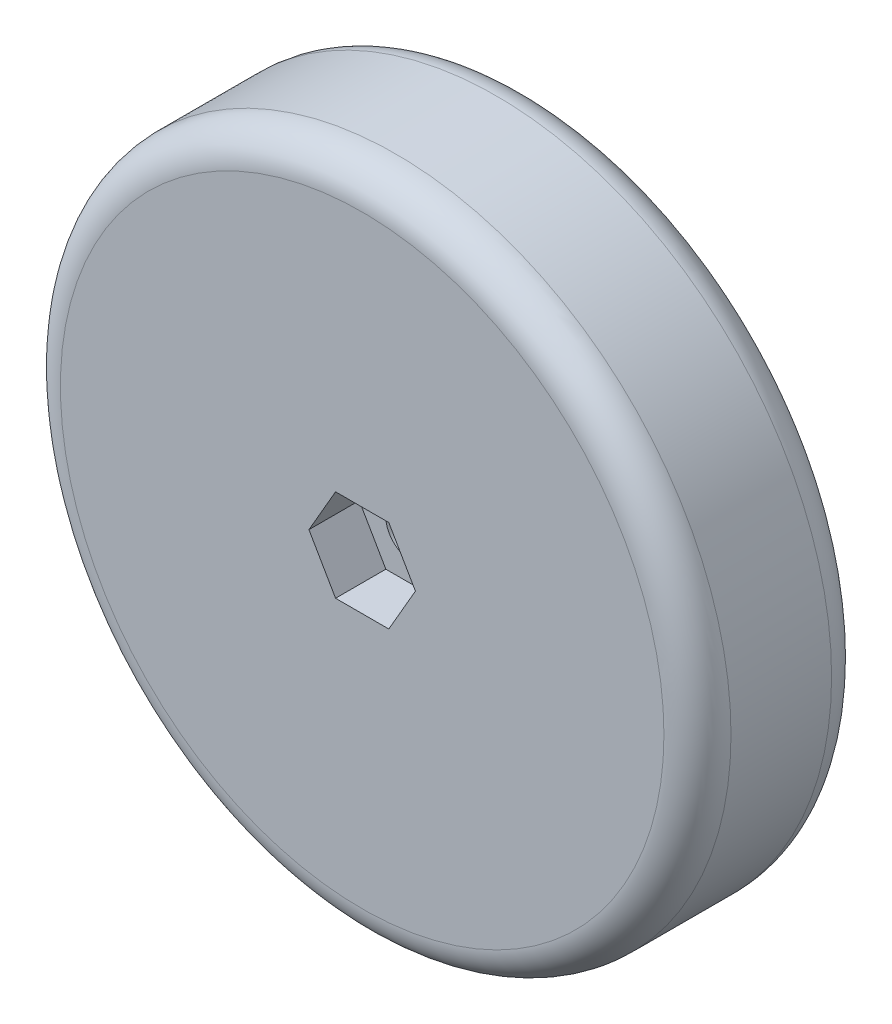
ISO-10303-21;
HEADER;
FILE_DESCRIPTION(('STEP AP214'),'2;1');
FILE_NAME('part.step','',(''),(''),'','','');
FILE_SCHEMA(('AUTOMOTIVE_DESIGN { 1 0 10303 214 1 1 1 1 }'));
ENDSEC;
DATA;
#1=APPLICATION_CONTEXT('core data for automotive mechanical design processes');
#2=APPLICATION_PROTOCOL_DEFINITION('international standard','automotive_design',2000,#1);
#3=PRODUCT_CONTEXT('',#1,'mechanical');
#4=PRODUCT('Part','Part','',(#3));
#5=PRODUCT_RELATED_PRODUCT_CATEGORY('part','',(#4));
#6=PRODUCT_DEFINITION_FORMATION('','',#4);
#7=PRODUCT_DEFINITION_CONTEXT('part definition',#1,'design');
#8=PRODUCT_DEFINITION('design','',#6,#7);
#9=PRODUCT_DEFINITION_SHAPE('','',#8);
#10=(LENGTH_UNIT() NAMED_UNIT(*) SI_UNIT(.MILLI.,.METRE.));
#11=(NAMED_UNIT(*) PLANE_ANGLE_UNIT() SI_UNIT($,.RADIAN.));
#12=(NAMED_UNIT(*) SI_UNIT($,.STERADIAN.) SOLID_ANGLE_UNIT());
#13=UNCERTAINTY_MEASURE_WITH_UNIT(LENGTH_MEASURE(1.E-05),#10,'distance_accuracy_value','');
#14=(GEOMETRIC_REPRESENTATION_CONTEXT(3) GLOBAL_UNCERTAINTY_ASSIGNED_CONTEXT((#13)) GLOBAL_UNIT_ASSIGNED_CONTEXT((#10,
#11,#12)) REPRESENTATION_CONTEXT('',''));
#15=CARTESIAN_POINT('',(0.,0.,0.));
#16=DIRECTION('',(0.,0.,1.));
#17=DIRECTION('',(1.,0.,0.));
#18=AXIS2_PLACEMENT_3D('',#15,#16,#17);
#19=CARTESIAN_POINT('',(0.,0.,0.));
#20=DIRECTION('',(0.,0.,1.));
#21=DIRECTION('',(1.,0.,0.));
#22=AXIS2_PLACEMENT_3D('',#19,#20,#21);
#23=PLANE('',#22);
#24=CARTESIAN_POINT('',(0.,0.,0.));
#25=DIRECTION('',(0.,0.,1.));
#26=DIRECTION('',(1.,0.,0.));
#27=AXIS2_PLACEMENT_3D('',#24,#25,#26);
#28=CIRCLE('',#27,18.);
#29=CARTESIAN_POINT('',(18.,0.,0.));
#30=VERTEX_POINT('',#29);
#31=EDGE_CURVE('E152',#30,#30,#28,.F.);
#32=ORIENTED_EDGE('',*,*,#31,.T.);
#33=EDGE_LOOP('',(#32));
#34=FACE_BOUND('',#33,.T.);
#35=CARTESIAN_POINT('',(0.,0.,0.));
#36=DIRECTION('',(0.,0.,1.));
#37=DIRECTION('',(1.,0.,0.));
#38=AXIS2_PLACEMENT_3D('',#35,#36,#37);
#39=CIRCLE('',#38,5.);
#40=CARTESIAN_POINT('',(5.,0.,0.));
#41=VERTEX_POINT('',#40);
#42=EDGE_CURVE('E11',#41,#41,#39,.F.);
#43=ORIENTED_EDGE('',*,*,#42,.F.);
#44=EDGE_LOOP('',(#43));
#45=FACE_BOUND('',#44,.T.);
#46=ADVANCED_FACE('F35',(#34,#45),#23,.F.);
#47=CARTESIAN_POINT('',(0.,0.,10.));
#48=DIRECTION('',(0.,0.,-1.));
#49=DIRECTION('',(-1.,0.,0.));
#50=AXIS2_PLACEMENT_3D('',#47,#48,#49);
#51=CYLINDRICAL_SURFACE('',#50,1.6);
#52=CARTESIAN_POINT('',(0.,0.,7.));
#53=DIRECTION('',(0.,0.,1.));
#54=DIRECTION('',(1.,0.,0.));
#55=AXIS2_PLACEMENT_3D('',#52,#53,#54);
#56=CIRCLE('',#55,1.6);
#57=CARTESIAN_POINT('',(1.6,0.,7.));
#58=VERTEX_POINT('',#57);
#59=EDGE_CURVE('E138',#58,#58,#56,.T.);
#60=ORIENTED_EDGE('',*,*,#59,.T.);
#61=EDGE_LOOP('',(#60));
#62=FACE_BOUND('',#61,.T.);
#63=CARTESIAN_POINT('',(0.,0.,-0.5));
#64=DIRECTION('',(0.,0.,-1.));
#65=DIRECTION('',(-1.,0.,0.));
#66=AXIS2_PLACEMENT_3D('',#63,#64,#65);
#67=CIRCLE('',#66,1.6);
#68=CARTESIAN_POINT('',(-1.6,0.,-0.5));
#69=VERTEX_POINT('',#68);
#70=EDGE_CURVE('E277',#69,#69,#67,.T.);
#71=ORIENTED_EDGE('',*,*,#70,.T.);
#72=EDGE_LOOP('',(#71));
#73=FACE_BOUND('',#72,.T.);
#74=ADVANCED_FACE('F175',(#62,#73),#51,.F.);
#75=CARTESIAN_POINT('',(0.,0.,10.));
#76=DIRECTION('',(0.,0.,1.));
#77=DIRECTION('',(1.,0.,0.));
#78=AXIS2_PLACEMENT_3D('',#75,#76,#77);
#79=PLANE('',#78);
#80=CARTESIAN_POINT('',(0.,0.,10.));
#81=DIRECTION('',(0.,0.,1.));
#82=DIRECTION('',(1.,0.,0.));
#83=AXIS2_PLACEMENT_3D('',#80,#81,#82);
#84=CIRCLE('',#83,18.);
#85=CARTESIAN_POINT('',(18.,0.,10.));
#86=VERTEX_POINT('',#85);
#87=EDGE_CURVE('E43',#86,#86,#84,.T.);
#88=ORIENTED_EDGE('',*,*,#87,.T.);
#89=EDGE_LOOP('',(#88));
#90=FACE_BOUND('',#89,.T.);
#91=DIRECTION('',(0.5,0.866025403784439,0.));
#92=VECTOR('',#91,1.);
#93=CARTESIAN_POINT('',(1.58771324027147,-2.75,10.));
#94=LINE('',#93,#92);
#95=CARTESIAN_POINT('',(1.58771324027147,-2.75,10.));
#96=VERTEX_POINT('',#95);
#97=CARTESIAN_POINT('',(3.17542648054294,0.,10.));
#98=VERTEX_POINT('',#97);
#99=EDGE_CURVE('E50',#96,#98,#94,.T.);
#100=ORIENTED_EDGE('',*,*,#99,.F.);
#101=DIRECTION('',(1.,0.,0.));
#102=VECTOR('',#101,1.);
#103=CARTESIAN_POINT('',(-1.58771324027147,-2.75,10.));
#104=LINE('',#103,#102);
#105=CARTESIAN_POINT('',(-1.58771324027147,-2.75,10.));
#106=VERTEX_POINT('',#105);
#107=EDGE_CURVE('E134',#106,#96,#104,.T.);
#108=ORIENTED_EDGE('',*,*,#107,.F.);
#109=DIRECTION('',(0.5,-0.866025403784439,0.));
#110=VECTOR('',#109,1.);
#111=CARTESIAN_POINT('',(-3.17542648054294,0.,10.));
#112=LINE('',#111,#110);
#113=CARTESIAN_POINT('',(-3.17542648054294,0.,10.));
#114=VERTEX_POINT('',#113);
#115=EDGE_CURVE('E132',#114,#106,#112,.T.);
#116=ORIENTED_EDGE('',*,*,#115,.F.);
#117=DIRECTION('',(-0.5,-0.866025403784439,0.));
#118=VECTOR('',#117,1.);
#119=CARTESIAN_POINT('',(-1.58771324027147,2.75,10.));
#120=LINE('',#119,#118);
#121=CARTESIAN_POINT('',(-1.58771324027147,2.75,10.));
#122=VERTEX_POINT('',#121);
#123=EDGE_CURVE('E98',#122,#114,#120,.T.);
#124=ORIENTED_EDGE('',*,*,#123,.F.);
#125=DIRECTION('',(-1.,0.,0.));
#126=VECTOR('',#125,1.);
#127=CARTESIAN_POINT('',(1.58771324027147,2.75,10.));
#128=LINE('',#127,#126);
#129=CARTESIAN_POINT('',(1.58771324027147,2.75,10.));
#130=VERTEX_POINT('',#129);
#131=EDGE_CURVE('E128',#130,#122,#128,.T.);
#132=ORIENTED_EDGE('',*,*,#131,.F.);
#133=DIRECTION('',(-0.5,0.866025403784438,0.));
#134=VECTOR('',#133,1.);
#135=CARTESIAN_POINT('',(3.17542648054294,0.,10.));
#136=LINE('',#135,#134);
#137=EDGE_CURVE('E124',#98,#130,#136,.T.);
#138=ORIENTED_EDGE('',*,*,#137,.F.);
#139=EDGE_LOOP('',(#100,#108,#116,#124,#132,#138));
#140=FACE_BOUND('',#139,.T.);
#141=ADVANCED_FACE('F157',(#90,#140),#79,.T.);
#142=CARTESIAN_POINT('',(0.,0.,10.));
#143=DIRECTION('',(0.,0.,-1.));
#144=DIRECTION('',(-1.,0.,0.));
#145=AXIS2_PLACEMENT_3D('',#142,#143,#144);
#146=CYLINDRICAL_SURFACE('',#145,20.);
#147=CARTESIAN_POINT('',(0.,0.,2.));
#148=DIRECTION('',(0.,0.,1.));
#149=DIRECTION('',(1.,0.,0.));
#150=AXIS2_PLACEMENT_3D('',#147,#148,#149);
#151=CIRCLE('',#150,20.);
#152=CARTESIAN_POINT('',(20.,0.,2.));
#153=VERTEX_POINT('',#152);
#154=EDGE_CURVE('E149',#153,#153,#151,.T.);
#155=ORIENTED_EDGE('',*,*,#154,.T.);
#156=EDGE_LOOP('',(#155));
#157=FACE_BOUND('',#156,.T.);
#158=CARTESIAN_POINT('',(0.,0.,8.));
#159=DIRECTION('',(0.,0.,1.));
#160=DIRECTION('',(1.,0.,0.));
#161=AXIS2_PLACEMENT_3D('',#158,#159,#160);
#162=CIRCLE('',#161,20.);
#163=CARTESIAN_POINT('',(20.,0.,8.));
#164=VERTEX_POINT('',#163);
#165=EDGE_CURVE('E146',#164,#164,#162,.F.);
#166=ORIENTED_EDGE('',*,*,#165,.T.);
#167=EDGE_LOOP('',(#166));
#168=FACE_BOUND('',#167,.T.);
#169=ADVANCED_FACE('F187',(#157,#168),#146,.T.);
#170=CARTESIAN_POINT('',(1.58771324027147,-2.75,7.));
#171=DIRECTION('',(0.866025403784439,-0.5,0.));
#172=DIRECTION('',(0.5,0.866025403784439,0.));
#173=AXIS2_PLACEMENT_3D('',#170,#171,#172);
#174=PLANE('',#173);
#175=ORIENTED_EDGE('',*,*,#99,.T.);
#176=DIRECTION('',(0.,0.,1.));
#177=VECTOR('',#176,1.);
#178=CARTESIAN_POINT('',(3.17542648054294,0.,7.));
#179=LINE('',#178,#177);
#180=CARTESIAN_POINT('',(3.17542648054294,0.,7.));
#181=VERTEX_POINT('',#180);
#182=EDGE_CURVE('E80',#181,#98,#179,.T.);
#183=ORIENTED_EDGE('',*,*,#182,.F.);
#184=DIRECTION('',(0.5,0.866025403784439,0.));
#185=VECTOR('',#184,1.);
#186=CARTESIAN_POINT('',(1.58771324027147,-2.75,7.));
#187=LINE('',#186,#185);
#188=CARTESIAN_POINT('',(1.58771324027147,-2.75,7.));
#189=VERTEX_POINT('',#188);
#190=EDGE_CURVE('E136',#189,#181,#187,.T.);
#191=ORIENTED_EDGE('',*,*,#190,.F.);
#192=DIRECTION('',(0.,0.,1.));
#193=VECTOR('',#192,1.);
#194=CARTESIAN_POINT('',(1.58771324027147,-2.75,7.));
#195=LINE('',#194,#193);
#196=EDGE_CURVE('E58',#189,#96,#195,.T.);
#197=ORIENTED_EDGE('',*,*,#196,.T.);
#198=EDGE_LOOP('',(#175,#183,#191,#197));
#199=FACE_BOUND('',#198,.T.);
#200=ADVANCED_FACE('F189',(#199),#174,.F.);
#201=CARTESIAN_POINT('',(-1.58771324027147,-2.75,7.));
#202=DIRECTION('',(0.,-1.,0.));
#203=DIRECTION('',(1.,0.,0.));
#204=AXIS2_PLACEMENT_3D('',#201,#202,#203);
#205=PLANE('',#204);
#206=ORIENTED_EDGE('',*,*,#107,.T.);
#207=ORIENTED_EDGE('',*,*,#196,.F.);
#208=DIRECTION('',(1.,0.,0.));
#209=VECTOR('',#208,1.);
#210=CARTESIAN_POINT('',(-1.58771324027147,-2.75,7.));
#211=LINE('',#210,#209);
#212=CARTESIAN_POINT('',(-1.58771324027147,-2.75,7.));
#213=VERTEX_POINT('',#212);
#214=EDGE_CURVE('E110',#213,#189,#211,.T.);
#215=ORIENTED_EDGE('',*,*,#214,.F.);
#216=DIRECTION('',(0.,0.,1.));
#217=VECTOR('',#216,1.);
#218=CARTESIAN_POINT('',(-1.58771324027147,-2.75,7.));
#219=LINE('',#218,#217);
#220=EDGE_CURVE('E102',#213,#106,#219,.T.);
#221=ORIENTED_EDGE('',*,*,#220,.T.);
#222=EDGE_LOOP('',(#206,#207,#215,#221));
#223=FACE_BOUND('',#222,.T.);
#224=ADVANCED_FACE('F195',(#223),#205,.F.);
#225=CARTESIAN_POINT('',(-3.17542648054294,0.,7.));
#226=DIRECTION('',(-0.866025403784439,-0.5,0.));
#227=DIRECTION('',(0.5,-0.866025403784439,0.));
#228=AXIS2_PLACEMENT_3D('',#225,#226,#227);
#229=PLANE('',#228);
#230=ORIENTED_EDGE('',*,*,#115,.T.);
#231=ORIENTED_EDGE('',*,*,#220,.F.);
#232=DIRECTION('',(0.5,-0.866025403784439,0.));
#233=VECTOR('',#232,1.);
#234=CARTESIAN_POINT('',(-3.17542648054294,0.,7.));
#235=LINE('',#234,#233);
#236=CARTESIAN_POINT('',(-3.17542648054294,0.,7.));
#237=VERTEX_POINT('',#236);
#238=EDGE_CURVE('E106',#237,#213,#235,.T.);
#239=ORIENTED_EDGE('',*,*,#238,.F.);
#240=DIRECTION('',(0.,0.,1.));
#241=VECTOR('',#240,1.);
#242=CARTESIAN_POINT('',(-3.17542648054294,0.,7.));
#243=LINE('',#242,#241);
#244=EDGE_CURVE('E91',#237,#114,#243,.T.);
#245=ORIENTED_EDGE('',*,*,#244,.T.);
#246=EDGE_LOOP('',(#230,#231,#239,#245));
#247=FACE_BOUND('',#246,.T.);
#248=ADVANCED_FACE('F107',(#247),#229,.F.);
#249=CARTESIAN_POINT('',(-1.58771324027147,2.75,7.));
#250=DIRECTION('',(-0.866025403784439,0.5,0.));
#251=DIRECTION('',(-0.5,-0.866025403784439,0.));
#252=AXIS2_PLACEMENT_3D('',#249,#250,#251);
#253=PLANE('',#252);
#254=ORIENTED_EDGE('',*,*,#123,.T.);
#255=ORIENTED_EDGE('',*,*,#244,.F.);
#256=DIRECTION('',(-0.5,-0.866025403784439,0.));
#257=VECTOR('',#256,1.);
#258=CARTESIAN_POINT('',(-1.58771324027147,2.75,7.));
#259=LINE('',#258,#257);
#260=CARTESIAN_POINT('',(-1.58771324027147,2.75,7.));
#261=VERTEX_POINT('',#260);
#262=EDGE_CURVE('E95',#261,#237,#259,.T.);
#263=ORIENTED_EDGE('',*,*,#262,.F.);
#264=DIRECTION('',(0.,0.,1.));
#265=VECTOR('',#264,1.);
#266=CARTESIAN_POINT('',(-1.58771324027147,2.75,7.));
#267=LINE('',#266,#265);
#268=EDGE_CURVE('E103',#261,#122,#267,.T.);
#269=ORIENTED_EDGE('',*,*,#268,.T.);
#270=EDGE_LOOP('',(#254,#255,#263,#269));
#271=FACE_BOUND('',#270,.T.);
#272=ADVANCED_FACE('F93',(#271),#253,.F.);
#273=CARTESIAN_POINT('',(1.58771324027147,2.75,7.));
#274=DIRECTION('',(0.,1.,0.));
#275=DIRECTION('',(0.,0.,1.));
#276=AXIS2_PLACEMENT_3D('',#273,#274,#275);
#277=PLANE('',#276);
#278=ORIENTED_EDGE('',*,*,#131,.T.);
#279=ORIENTED_EDGE('',*,*,#268,.F.);
#280=DIRECTION('',(-1.,0.,0.));
#281=VECTOR('',#280,1.);
#282=CARTESIAN_POINT('',(1.58771324027147,2.75,7.));
#283=LINE('',#282,#281);
#284=CARTESIAN_POINT('',(1.58771324027147,2.75,7.));
#285=VERTEX_POINT('',#284);
#286=EDGE_CURVE('E116',#285,#261,#283,.T.);
#287=ORIENTED_EDGE('',*,*,#286,.F.);
#288=DIRECTION('',(0.,0.,1.));
#289=VECTOR('',#288,1.);
#290=CARTESIAN_POINT('',(1.58771324027147,2.75,7.));
#291=LINE('',#290,#289);
#292=EDGE_CURVE('E141',#285,#130,#291,.T.);
#293=ORIENTED_EDGE('',*,*,#292,.T.);
#294=EDGE_LOOP('',(#278,#279,#287,#293));
#295=FACE_BOUND('',#294,.T.);
#296=ADVANCED_FACE('F264',(#295),#277,.F.);
#297=CARTESIAN_POINT('',(3.17542648054294,0.,7.));
#298=DIRECTION('',(0.866025403784439,0.5,0.));
#299=DIRECTION('',(-0.5,0.866025403784439,0.));
#300=AXIS2_PLACEMENT_3D('',#297,#298,#299);
#301=PLANE('',#300);
#302=ORIENTED_EDGE('',*,*,#137,.T.);
#303=ORIENTED_EDGE('',*,*,#292,.F.);
#304=DIRECTION('',(-0.5,0.866025403784438,0.));
#305=VECTOR('',#304,1.);
#306=CARTESIAN_POINT('',(3.17542648054294,0.,7.));
#307=LINE('',#306,#305);
#308=EDGE_CURVE('E118',#181,#285,#307,.T.);
#309=ORIENTED_EDGE('',*,*,#308,.F.);
#310=ORIENTED_EDGE('',*,*,#182,.T.);
#311=EDGE_LOOP('',(#302,#303,#309,#310));
#312=FACE_BOUND('',#311,.T.);
#313=ADVANCED_FACE('F256',(#312),#301,.F.);
#314=CARTESIAN_POINT('',(0.,0.,7.));
#315=DIRECTION('',(0.,0.,1.));
#316=DIRECTION('',(1.,0.,0.));
#317=AXIS2_PLACEMENT_3D('',#314,#315,#316);
#318=PLANE('',#317);
#319=ORIENTED_EDGE('',*,*,#59,.F.);
#320=EDGE_LOOP('',(#319));
#321=FACE_BOUND('',#320,.T.);
#322=ORIENTED_EDGE('',*,*,#190,.T.);
#323=ORIENTED_EDGE('',*,*,#308,.T.);
#324=ORIENTED_EDGE('',*,*,#286,.T.);
#325=ORIENTED_EDGE('',*,*,#262,.T.);
#326=ORIENTED_EDGE('',*,*,#238,.T.);
#327=ORIENTED_EDGE('',*,*,#214,.T.);
#328=EDGE_LOOP('',(#322,#323,#324,#325,#326,#327));
#329=FACE_BOUND('',#328,.T.);
#330=ADVANCED_FACE('F113',(#321,#329),#318,.T.);
#331=CARTESIAN_POINT('',(0.,0.,2.));
#332=DIRECTION('',(0.,0.,1.));
#333=DIRECTION('',(1.,0.,0.));
#334=AXIS2_PLACEMENT_3D('',#331,#332,#333);
#335=TOROIDAL_SURFACE('',#334,18.,2.);
#336=ORIENTED_EDGE('',*,*,#31,.F.);
#337=EDGE_LOOP('',(#336));
#338=FACE_BOUND('',#337,.T.);
#339=ORIENTED_EDGE('',*,*,#154,.F.);
#340=EDGE_LOOP('',(#339));
#341=FACE_BOUND('',#340,.T.);
#342=ADVANCED_FACE('F162',(#338,#341),#335,.T.);
#343=CARTESIAN_POINT('',(0.,0.,8.));
#344=DIRECTION('',(0.,0.,1.));
#345=DIRECTION('',(1.,0.,0.));
#346=AXIS2_PLACEMENT_3D('',#343,#344,#345);
#347=TOROIDAL_SURFACE('',#346,18.,2.);
#348=ORIENTED_EDGE('',*,*,#165,.F.);
#349=EDGE_LOOP('',(#348));
#350=FACE_BOUND('',#349,.T.);
#351=ORIENTED_EDGE('',*,*,#87,.F.);
#352=EDGE_LOOP('',(#351));
#353=FACE_BOUND('',#352,.T.);
#354=ADVANCED_FACE('F37',(#350,#353),#347,.T.);
#355=CARTESIAN_POINT('',(0.,0.,-0.5));
#356=DIRECTION('',(0.,0.,-1.));
#357=DIRECTION('',(-1.,0.,0.));
#358=AXIS2_PLACEMENT_3D('',#355,#356,#357);
#359=PLANE('',#358);
#360=CARTESIAN_POINT('',(0.,0.,-0.5));
#361=DIRECTION('',(0.,0.,-1.));
#362=DIRECTION('',(-1.,0.,0.));
#363=AXIS2_PLACEMENT_3D('',#360,#361,#362);
#364=CIRCLE('',#363,5.);
#365=CARTESIAN_POINT('',(-5.,0.,-0.5));
#366=VERTEX_POINT('',#365);
#367=EDGE_CURVE('E125',#366,#366,#364,.T.);
#368=ORIENTED_EDGE('',*,*,#367,.T.);
#369=EDGE_LOOP('',(#368));
#370=FACE_BOUND('',#369,.T.);
#371=ORIENTED_EDGE('',*,*,#70,.F.);
#372=EDGE_LOOP('',(#371));
#373=FACE_BOUND('',#372,.T.);
#374=ADVANCED_FACE('F161',(#370,#373),#359,.T.);
#375=CARTESIAN_POINT('',(0.,0.,-0.5));
#376=DIRECTION('',(0.,0.,1.));
#377=DIRECTION('',(1.,0.,0.));
#378=AXIS2_PLACEMENT_3D('',#375,#376,#377);
#379=CYLINDRICAL_SURFACE('',#378,5.);
#380=ORIENTED_EDGE('',*,*,#367,.F.);
#381=EDGE_LOOP('',(#380));
#382=FACE_BOUND('',#381,.T.);
#383=ORIENTED_EDGE('',*,*,#42,.T.);
#384=EDGE_LOOP('',(#383));
#385=FACE_BOUND('',#384,.T.);
#386=ADVANCED_FACE('F169',(#382,#385),#379,.T.);
#387=CLOSED_SHELL('',(#46,#74,#141,#169,#200,#224,#248,#272,#296,#313,#330,#342,#354,#374,#386));
#388=MANIFOLD_SOLID_BREP('B2',#387);
#389=ADVANCED_BREP_SHAPE_REPRESENTATION('',(#18,#388),#14);
#390=SHAPE_DEFINITION_REPRESENTATION(#9,#389);
ENDSEC;
END-ISO-10303-21;
